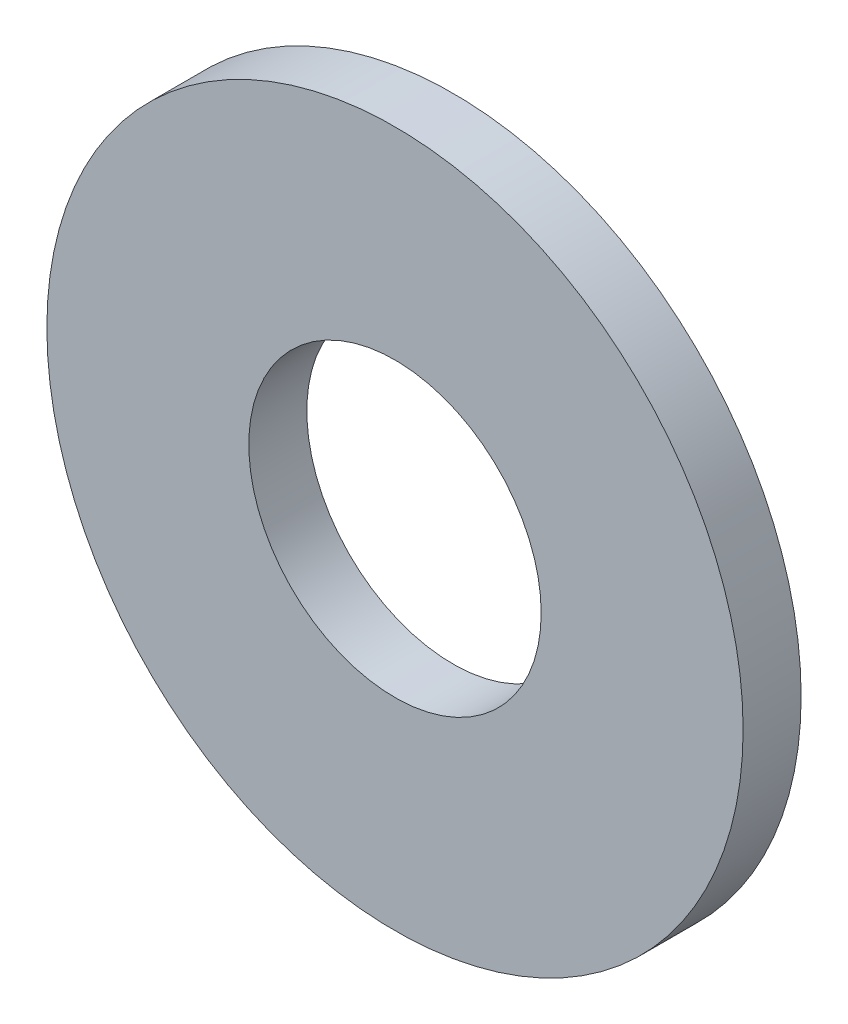
ISO-10303-21;
HEADER;
FILE_DESCRIPTION(('STEP AP214'),'2;1');
FILE_NAME('part.step','',(''),(''),'','','');
FILE_SCHEMA(('AUTOMOTIVE_DESIGN { 1 0 10303 214 1 1 1 1 }'));
ENDSEC;
DATA;
#1=APPLICATION_CONTEXT('core data for automotive mechanical design processes');
#2=APPLICATION_PROTOCOL_DEFINITION('international standard','automotive_design',2000,#1);
#3=PRODUCT_CONTEXT('',#1,'mechanical');
#4=PRODUCT('Part','Part','',(#3));
#5=PRODUCT_RELATED_PRODUCT_CATEGORY('part','',(#4));
#6=PRODUCT_DEFINITION_FORMATION('','',#4);
#7=PRODUCT_DEFINITION_CONTEXT('part definition',#1,'design');
#8=PRODUCT_DEFINITION('design','',#6,#7);
#9=PRODUCT_DEFINITION_SHAPE('','',#8);
#10=(LENGTH_UNIT() NAMED_UNIT(*) SI_UNIT(.MILLI.,.METRE.));
#11=(NAMED_UNIT(*) PLANE_ANGLE_UNIT() SI_UNIT($,.RADIAN.));
#12=(NAMED_UNIT(*) SI_UNIT($,.STERADIAN.) SOLID_ANGLE_UNIT());
#13=UNCERTAINTY_MEASURE_WITH_UNIT(LENGTH_MEASURE(1.E-05),#10,'distance_accuracy_value','');
#14=(GEOMETRIC_REPRESENTATION_CONTEXT(3) GLOBAL_UNCERTAINTY_ASSIGNED_CONTEXT((#13)) GLOBAL_UNIT_ASSIGNED_CONTEXT((#10,
#11,#12)) REPRESENTATION_CONTEXT('',''));
#15=CARTESIAN_POINT('',(0.,0.,0.));
#16=DIRECTION('',(0.,0.,1.));
#17=DIRECTION('',(1.,0.,0.));
#18=AXIS2_PLACEMENT_3D('',#15,#16,#17);
#19=CARTESIAN_POINT('',(0.,0.,1.5875));
#20=DIRECTION('',(0.,0.,1.));
#21=DIRECTION('',(1.,0.,0.));
#22=AXIS2_PLACEMENT_3D('',#19,#20,#21);
#23=PLANE('',#22);
#24=CARTESIAN_POINT('',(0.,0.,1.5875));
#25=DIRECTION('',(0.,0.,1.));
#26=DIRECTION('',(1.,0.,0.));
#27=AXIS2_PLACEMENT_3D('',#24,#25,#26);
#28=CIRCLE('',#27,9.525);
#29=CARTESIAN_POINT('',(9.525,0.,1.5875));
#30=VERTEX_POINT('',#29);
#31=EDGE_CURVE('E10',#30,#30,#28,.T.);
#32=ORIENTED_EDGE('',*,*,#31,.T.);
#33=EDGE_LOOP('',(#32));
#34=FACE_BOUND('',#33,.T.);
#35=CARTESIAN_POINT('',(0.,0.,1.5875));
#36=DIRECTION('',(0.,0.,1.));
#37=DIRECTION('',(1.,0.,0.));
#38=AXIS2_PLACEMENT_3D('',#35,#36,#37);
#39=CIRCLE('',#38,4.);
#40=CARTESIAN_POINT('',(4.,0.,1.5875));
#41=VERTEX_POINT('',#40);
#42=EDGE_CURVE('E42',#41,#41,#39,.T.);
#43=ORIENTED_EDGE('',*,*,#42,.F.);
#44=EDGE_LOOP('',(#43));
#45=FACE_BOUND('',#44,.T.);
#46=ADVANCED_FACE('F31',(#34,#45),#23,.T.);
#47=CARTESIAN_POINT('',(0.,0.,0.));
#48=DIRECTION('',(0.,0.,1.));
#49=DIRECTION('',(1.,0.,0.));
#50=AXIS2_PLACEMENT_3D('',#47,#48,#49);
#51=PLANE('',#50);
#52=CARTESIAN_POINT('',(0.,0.,0.));
#53=DIRECTION('',(0.,0.,1.));
#54=DIRECTION('',(1.,0.,0.));
#55=AXIS2_PLACEMENT_3D('',#52,#53,#54);
#56=CIRCLE('',#55,9.525);
#57=CARTESIAN_POINT('',(9.525,0.,0.));
#58=VERTEX_POINT('',#57);
#59=EDGE_CURVE('E35',#58,#58,#56,.T.);
#60=ORIENTED_EDGE('',*,*,#59,.F.);
#61=EDGE_LOOP('',(#60));
#62=FACE_BOUND('',#61,.T.);
#63=CARTESIAN_POINT('',(0.,0.,0.));
#64=DIRECTION('',(0.,0.,1.));
#65=DIRECTION('',(1.,0.,0.));
#66=AXIS2_PLACEMENT_3D('',#63,#64,#65);
#67=CIRCLE('',#66,4.);
#68=CARTESIAN_POINT('',(4.,0.,0.));
#69=VERTEX_POINT('',#68);
#70=EDGE_CURVE('E44',#69,#69,#67,.T.);
#71=ORIENTED_EDGE('',*,*,#70,.T.);
#72=EDGE_LOOP('',(#71));
#73=FACE_BOUND('',#72,.T.);
#74=ADVANCED_FACE('F54',(#62,#73),#51,.F.);
#75=CARTESIAN_POINT('',(0.,0.,1.5875));
#76=DIRECTION('',(0.,0.,-1.));
#77=DIRECTION('',(-1.,0.,0.));
#78=AXIS2_PLACEMENT_3D('',#75,#76,#77);
#79=CYLINDRICAL_SURFACE('',#78,9.525);
#80=ORIENTED_EDGE('',*,*,#31,.F.);
#81=EDGE_LOOP('',(#80));
#82=FACE_BOUND('',#81,.T.);
#83=ORIENTED_EDGE('',*,*,#59,.T.);
#84=EDGE_LOOP('',(#83));
#85=FACE_BOUND('',#84,.T.);
#86=ADVANCED_FACE('F33',(#82,#85),#79,.T.);
#87=CARTESIAN_POINT('',(0.,0.,1.5875));
#88=DIRECTION('',(0.,0.,-1.));
#89=DIRECTION('',(-1.,0.,0.));
#90=AXIS2_PLACEMENT_3D('',#87,#88,#89);
#91=CYLINDRICAL_SURFACE('',#90,4.);
#92=ORIENTED_EDGE('',*,*,#42,.T.);
#93=EDGE_LOOP('',(#92));
#94=FACE_BOUND('',#93,.T.);
#95=ORIENTED_EDGE('',*,*,#70,.F.);
#96=EDGE_LOOP('',(#95));
#97=FACE_BOUND('',#96,.T.);
#98=ADVANCED_FACE('F50',(#94,#97),#91,.F.);
#99=CLOSED_SHELL('',(#46,#74,#86,#98));
#100=MANIFOLD_SOLID_BREP('B2',#99);
#101=ADVANCED_BREP_SHAPE_REPRESENTATION('',(#18,#100),#14);
#102=SHAPE_DEFINITION_REPRESENTATION(#9,#101);
ENDSEC;
END-ISO-10303-21;
